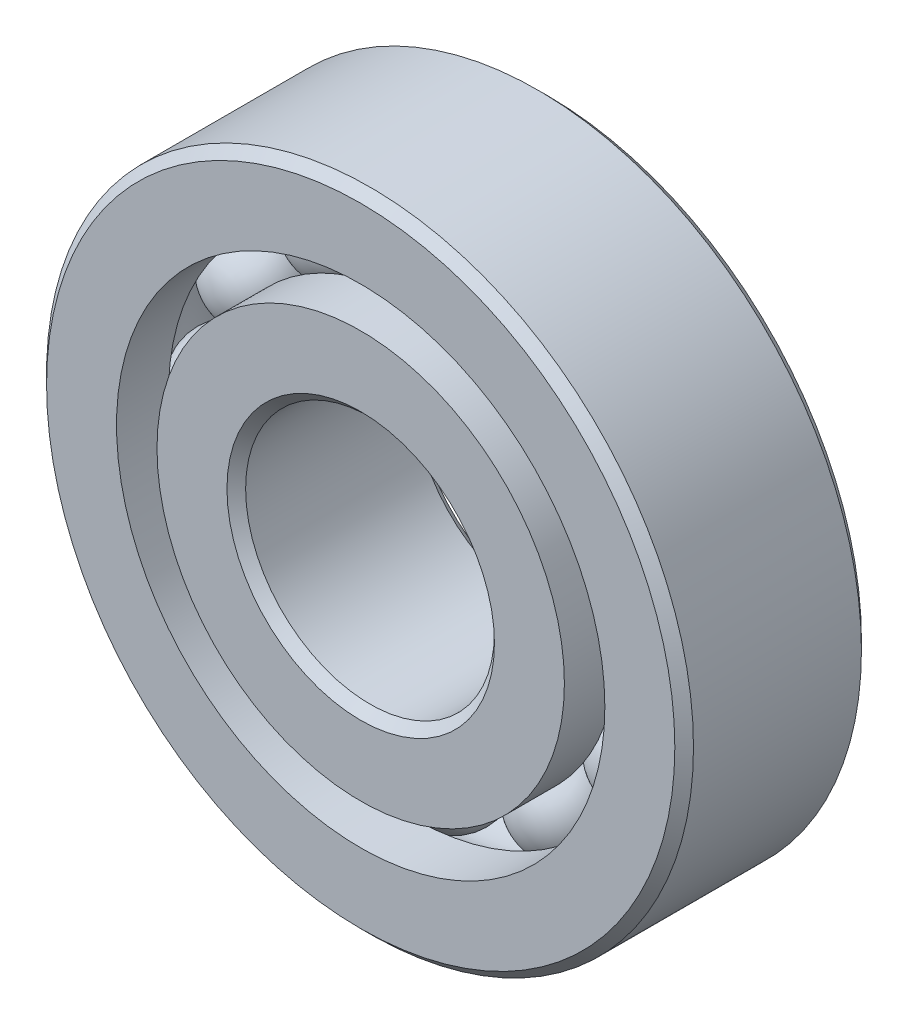
ISO-10303-21;
HEADER;
FILE_DESCRIPTION(('STEP AP214'),'2;1');
FILE_NAME('part.step','',(''),(''),'','','');
FILE_SCHEMA(('AUTOMOTIVE_DESIGN { 1 0 10303 214 1 1 1 1 }'));
ENDSEC;
DATA;
#1=APPLICATION_CONTEXT('core data for automotive mechanical design processes');
#2=APPLICATION_PROTOCOL_DEFINITION('international standard','automotive_design',2000,#1);
#3=PRODUCT_CONTEXT('',#1,'mechanical');
#4=PRODUCT('Part','Part','',(#3));
#5=PRODUCT_RELATED_PRODUCT_CATEGORY('part','',(#4));
#6=PRODUCT_DEFINITION_FORMATION('','',#4);
#7=PRODUCT_DEFINITION_CONTEXT('part definition',#1,'design');
#8=PRODUCT_DEFINITION('design','',#6,#7);
#9=PRODUCT_DEFINITION_SHAPE('','',#8);
#10=(LENGTH_UNIT() NAMED_UNIT(*) SI_UNIT(.MILLI.,.METRE.));
#11=(NAMED_UNIT(*) PLANE_ANGLE_UNIT() SI_UNIT($,.RADIAN.));
#12=(NAMED_UNIT(*) SI_UNIT($,.STERADIAN.) SOLID_ANGLE_UNIT());
#13=UNCERTAINTY_MEASURE_WITH_UNIT(LENGTH_MEASURE(1.E-05),#10,'distance_accuracy_value','');
#14=(GEOMETRIC_REPRESENTATION_CONTEXT(3) GLOBAL_UNCERTAINTY_ASSIGNED_CONTEXT((#13)) GLOBAL_UNIT_ASSIGNED_CONTEXT((#10,
#11,#12)) REPRESENTATION_CONTEXT('',''));
#15=CARTESIAN_POINT('',(0.,0.,0.));
#16=DIRECTION('',(0.,0.,1.));
#17=DIRECTION('',(1.,0.,0.));
#18=AXIS2_PLACEMENT_3D('',#15,#16,#17);
#19=CARTESIAN_POINT('',(-8.9999999999998,15.58845726812,0.));
#20=DIRECTION('',(0.,0.,1.));
#21=DIRECTION('',(-0.499999999999989,0.866025403784445,0.));
#22=AXIS2_PLACEMENT_3D('',#19,#20,#21);
#23=SPHERICAL_SURFACE('',#22,3.70893546501888);
#24=CARTESIAN_POINT('',(-8.9999999999998,15.58845726812,3.70893546501888));
#25=VERTEX_POINT('',#24);
#26=VERTEX_LOOP('',#25);
#27=FACE_BOUND('',#26,.T.);
#28=ADVANCED_FACE('F37',(#27),#23,.T.);
#29=CLOSED_SHELL('',(#28));
#30=MANIFOLD_SOLID_BREP('B2',#29);
#31=CARTESIAN_POINT('',(-15.5884572681198,9.00000000000018,0.));
#32=DIRECTION('',(0.,0.,1.));
#33=DIRECTION('',(-0.866025403784433,0.50000000000001,0.));
#34=AXIS2_PLACEMENT_3D('',#31,#32,#33);
#35=SPHERICAL_SURFACE('',#34,3.70893546501888);
#36=CARTESIAN_POINT('',(-15.5884572681198,9.00000000000018,3.70893546501888));
#37=VERTEX_POINT('',#36);
#38=VERTEX_LOOP('',#37);
#39=FACE_BOUND('',#38,.T.);
#40=ADVANCED_FACE('F57',(#39),#35,.T.);
#41=CLOSED_SHELL('',(#40));
#42=MANIFOLD_SOLID_BREP('B6',#41);
#43=CARTESIAN_POINT('',(-18.,1.88539992297529E-13,0.));
#44=DIRECTION('',(0.,0.,1.));
#45=DIRECTION('',(-1.,0.,0.));
#46=AXIS2_PLACEMENT_3D('',#43,#44,#45);
#47=SPHERICAL_SURFACE('',#46,3.70893546501888);
#48=CARTESIAN_POINT('',(-18.,1.88539992297529E-13,3.70893546501888));
#49=VERTEX_POINT('',#48);
#50=VERTEX_LOOP('',#49);
#51=FACE_BOUND('',#50,.T.);
#52=ADVANCED_FACE('F77',(#51),#47,.T.);
#53=CLOSED_SHELL('',(#52));
#54=MANIFOLD_SOLID_BREP('B33',#53);
#55=CARTESIAN_POINT('',(-15.58845726812,-8.99999999999985,0.));
#56=DIRECTION('',(0.,0.,1.));
#57=DIRECTION('',(-0.866025403784443,-0.499999999999992,0.));
#58=AXIS2_PLACEMENT_3D('',#55,#56,#57);
#59=SPHERICAL_SURFACE('',#58,3.70893546501888);
#60=CARTESIAN_POINT('',(-15.58845726812,-8.99999999999985,3.70893546501888));
#61=VERTEX_POINT('',#60);
#62=VERTEX_LOOP('',#61);
#63=FACE_BOUND('',#62,.T.);
#64=ADVANCED_FACE('F97',(#63),#59,.T.);
#65=CLOSED_SHELL('',(#64));
#66=MANIFOLD_SOLID_BREP('B53',#65);
#67=CARTESIAN_POINT('',(-9.00000000000013,-15.5884572681198,0.));
#68=DIRECTION('',(0.,0.,1.));
#69=DIRECTION('',(-0.500000000000007,-0.866025403784435,0.));
#70=AXIS2_PLACEMENT_3D('',#67,#68,#69);
#71=SPHERICAL_SURFACE('',#70,3.70893546501888);
#72=CARTESIAN_POINT('',(-9.00000000000013,-15.5884572681198,3.70893546501888));
#73=VERTEX_POINT('',#72);
#74=VERTEX_LOOP('',#73);
#75=FACE_BOUND('',#74,.T.);
#76=ADVANCED_FACE('F117',(#75),#71,.T.);
#77=CLOSED_SHELL('',(#76));
#78=MANIFOLD_SOLID_BREP('B73',#77);
#79=CARTESIAN_POINT('',(-1.25693328198353E-13,-18.,0.));
#80=DIRECTION('',(0.,0.,1.));
#81=DIRECTION('',(0.,-1.,0.));
#82=AXIS2_PLACEMENT_3D('',#79,#80,#81);
#83=SPHERICAL_SURFACE('',#82,3.70893546501888);
#84=CARTESIAN_POINT('',(-1.25693328198353E-13,-18.,3.70893546501888));
#85=VERTEX_POINT('',#84);
#86=VERTEX_LOOP('',#85);
#87=FACE_BOUND('',#86,.T.);
#88=ADVANCED_FACE('F137',(#87),#83,.T.);
#89=CLOSED_SHELL('',(#88));
#90=MANIFOLD_SOLID_BREP('B93',#89);
#91=CARTESIAN_POINT('',(8.99999999999991,-15.5884572681199,0.));
#92=DIRECTION('',(0.,0.,1.));
#93=DIRECTION('',(0.499999999999995,-0.866025403784442,0.));
#94=AXIS2_PLACEMENT_3D('',#91,#92,#93);
#95=SPHERICAL_SURFACE('',#94,3.70893546501888);
#96=CARTESIAN_POINT('',(8.99999999999991,-15.5884572681199,3.70893546501888));
#97=VERTEX_POINT('',#96);
#98=VERTEX_LOOP('',#97);
#99=FACE_BOUND('',#98,.T.);
#100=ADVANCED_FACE('F157',(#99),#95,.T.);
#101=CLOSED_SHELL('',(#100));
#102=MANIFOLD_SOLID_BREP('B113',#101);
#103=CARTESIAN_POINT('',(15.5884572681199,-9.00000000000007,0.));
#104=DIRECTION('',(0.,0.,1.));
#105=DIRECTION('',(0.866025403784436,-0.500000000000004,0.));
#106=AXIS2_PLACEMENT_3D('',#103,#104,#105);
#107=SPHERICAL_SURFACE('',#106,3.70893546501888);
#108=CARTESIAN_POINT('',(15.5884572681199,-9.00000000000007,3.70893546501888));
#109=VERTEX_POINT('',#108);
#110=VERTEX_LOOP('',#109);
#111=FACE_BOUND('',#110,.T.);
#112=ADVANCED_FACE('F177',(#111),#107,.T.);
#113=CLOSED_SHELL('',(#112));
#114=MANIFOLD_SOLID_BREP('B133',#113);
#115=CARTESIAN_POINT('',(18.,0.,0.));
#116=DIRECTION('',(0.,0.,1.));
#117=DIRECTION('',(1.,0.,0.));
#118=AXIS2_PLACEMENT_3D('',#115,#116,#117);
#119=SPHERICAL_SURFACE('',#118,3.70893546501888);
#120=CARTESIAN_POINT('',(18.,0.,3.70893546501888));
#121=VERTEX_POINT('',#120);
#122=VERTEX_LOOP('',#121);
#123=FACE_BOUND('',#122,.T.);
#124=ADVANCED_FACE('F197',(#123),#119,.T.);
#125=CLOSED_SHELL('',(#124));
#126=MANIFOLD_SOLID_BREP('B153',#125);
#127=CARTESIAN_POINT('',(15.5884572681199,8.99999999999996,0.));
#128=DIRECTION('',(0.,0.,1.));
#129=DIRECTION('',(0.86602540378444,0.499999999999998,0.));
#130=AXIS2_PLACEMENT_3D('',#127,#128,#129);
#131=SPHERICAL_SURFACE('',#130,3.70893546501888);
#132=CARTESIAN_POINT('',(15.5884572681199,8.99999999999996,3.70893546501888));
#133=VERTEX_POINT('',#132);
#134=VERTEX_LOOP('',#133);
#135=FACE_BOUND('',#134,.T.);
#136=ADVANCED_FACE('F217',(#135),#131,.T.);
#137=CLOSED_SHELL('',(#136));
#138=MANIFOLD_SOLID_BREP('B173',#137);
#139=CARTESIAN_POINT('',(9.00000000000002,15.5884572681199,0.));
#140=DIRECTION('',(0.,0.,1.));
#141=DIRECTION('',(0.500000000000001,0.866025403784438,0.));
#142=AXIS2_PLACEMENT_3D('',#139,#140,#141);
#143=SPHERICAL_SURFACE('',#142,3.70893546501888);
#144=CARTESIAN_POINT('',(9.00000000000002,15.5884572681199,3.70893546501888));
#145=VERTEX_POINT('',#144);
#146=VERTEX_LOOP('',#145);
#147=FACE_BOUND('',#146,.T.);
#148=ADVANCED_FACE('F237',(#147),#143,.T.);
#149=CLOSED_SHELL('',(#148));
#150=MANIFOLD_SOLID_BREP('B193',#149);
#151=CARTESIAN_POINT('',(0.,18.,0.));
#152=DIRECTION('',(0.,0.,1.));
#153=DIRECTION('',(0.,1.,0.));
#154=AXIS2_PLACEMENT_3D('',#151,#152,#153);
#155=SPHERICAL_SURFACE('',#154,3.70893546501888);
#156=CARTESIAN_POINT('',(0.,18.,3.70893546501888));
#157=VERTEX_POINT('',#156);
#158=VERTEX_LOOP('',#157);
#159=FACE_BOUND('',#158,.T.);
#160=ADVANCED_FACE('F259',(#159),#155,.T.);
#161=CLOSED_SHELL('',(#160));
#162=MANIFOLD_SOLID_BREP('B213',#161);
#163=CARTESIAN_POINT('',(0.,16.3736263736264,7.5));
#164=DIRECTION('',(0.,0.,-1.));
#165=DIRECTION('',(-1.,0.,0.));
#166=AXIS2_PLACEMENT_3D('',#163,#164,#165);
#167=PLANE('',#166);
#168=CARTESIAN_POINT('',(0.,0.,7.5));
#169=DIRECTION('',(0.,0.,1.));
#170=DIRECTION('',(1.,0.,0.));
#171=AXIS2_PLACEMENT_3D('',#168,#169,#170);
#172=CIRCLE('',#171,10.75);
#173=CARTESIAN_POINT('',(10.75,0.,7.5));
#174=VERTEX_POINT('',#173);
#175=EDGE_CURVE('E306',#174,#174,#172,.T.);
#176=ORIENTED_EDGE('',*,*,#175,.F.);
#177=EDGE_LOOP('',(#176));
#178=FACE_BOUND('',#177,.T.);
#179=CARTESIAN_POINT('',(0.,0.,7.50000000000001));
#180=DIRECTION('',(0.,0.,1.));
#181=DIRECTION('',(1.,0.,0.));
#182=AXIS2_PLACEMENT_3D('',#179,#180,#181);
#183=CIRCLE('',#182,16.3736263736264);
#184=CARTESIAN_POINT('',(16.3736263736264,0.,7.50000000000001));
#185=VERTEX_POINT('',#184);
#186=EDGE_CURVE('E258',#185,#185,#183,.T.);
#187=ORIENTED_EDGE('',*,*,#186,.T.);
#188=EDGE_LOOP('',(#187));
#189=FACE_BOUND('',#188,.T.);
#190=ADVANCED_FACE('F278',(#178,#189),#167,.F.);
#191=CARTESIAN_POINT('',(0.,0.,7.5));
#192=DIRECTION('',(0.,0.,1.));
#193=DIRECTION('',(1.,0.,0.));
#194=AXIS2_PLACEMENT_3D('',#191,#192,#193);
#195=CYLINDRICAL_SURFACE('',#194,16.3736263736264);
#196=ORIENTED_EDGE('',*,*,#186,.F.);
#197=EDGE_LOOP('',(#196));
#198=FACE_BOUND('',#197,.T.);
#199=CARTESIAN_POINT('',(0.,0.,3.33333333333333));
#200=DIRECTION('',(0.,0.,1.));
#201=DIRECTION('',(1.,0.,0.));
#202=AXIS2_PLACEMENT_3D('',#199,#200,#201);
#203=CIRCLE('',#202,16.3736263736264);
#204=CARTESIAN_POINT('',(16.3736263736264,0.,3.33333333333333));
#205=VERTEX_POINT('',#204);
#206=EDGE_CURVE('E284',#205,#205,#203,.T.);
#207=ORIENTED_EDGE('',*,*,#206,.T.);
#208=EDGE_LOOP('',(#207));
#209=FACE_BOUND('',#208,.T.);
#210=ADVANCED_FACE('F313',(#198,#209),#195,.T.);
#211=CARTESIAN_POINT('',(0.,0.,0.));
#212=DIRECTION('',(0.,0.,1.));
#213=DIRECTION('',(1.,0.,0.));
#214=AXIS2_PLACEMENT_3D('',#211,#212,#213);
#215=TOROIDAL_SURFACE('',#214,18.,3.70893546501887);
#216=ORIENTED_EDGE('',*,*,#206,.F.);
#217=EDGE_LOOP('',(#216));
#218=FACE_BOUND('',#217,.T.);
#219=CARTESIAN_POINT('',(0.,0.,-3.33333333333334));
#220=DIRECTION('',(0.,0.,1.));
#221=DIRECTION('',(1.,0.,0.));
#222=AXIS2_PLACEMENT_3D('',#219,#220,#221);
#223=CIRCLE('',#222,16.3736263736264);
#224=CARTESIAN_POINT('',(16.3736263736264,0.,-3.33333333333334));
#225=VERTEX_POINT('',#224);
#226=EDGE_CURVE('E288',#225,#225,#223,.T.);
#227=ORIENTED_EDGE('',*,*,#226,.T.);
#228=EDGE_LOOP('',(#227));
#229=FACE_BOUND('',#228,.T.);
#230=ADVANCED_FACE('F317',(#218,#229),#215,.F.);
#231=CARTESIAN_POINT('',(0.,0.,7.5));
#232=DIRECTION('',(0.,0.,1.));
#233=DIRECTION('',(1.,0.,0.));
#234=AXIS2_PLACEMENT_3D('',#231,#232,#233);
#235=CYLINDRICAL_SURFACE('',#234,16.3736263736264);
#236=ORIENTED_EDGE('',*,*,#226,.F.);
#237=EDGE_LOOP('',(#236));
#238=FACE_BOUND('',#237,.T.);
#239=CARTESIAN_POINT('',(0.,0.,-7.50000000000001));
#240=DIRECTION('',(0.,0.,1.));
#241=DIRECTION('',(1.,0.,0.));
#242=AXIS2_PLACEMENT_3D('',#239,#240,#241);
#243=CIRCLE('',#242,16.3736263736264);
#244=CARTESIAN_POINT('',(16.3736263736264,0.,-7.50000000000001));
#245=VERTEX_POINT('',#244);
#246=EDGE_CURVE('E292',#245,#245,#243,.T.);
#247=ORIENTED_EDGE('',*,*,#246,.T.);
#248=EDGE_LOOP('',(#247));
#249=FACE_BOUND('',#248,.T.);
#250=ADVANCED_FACE('F322',(#238,#249),#235,.T.);
#251=CARTESIAN_POINT('',(0.,10.75,-7.50000000000001));
#252=DIRECTION('',(0.,0.,1.));
#253=DIRECTION('',(1.,0.,0.));
#254=AXIS2_PLACEMENT_3D('',#251,#252,#253);
#255=PLANE('',#254);
#256=ORIENTED_EDGE('',*,*,#246,.F.);
#257=EDGE_LOOP('',(#256));
#258=FACE_BOUND('',#257,.T.);
#259=CARTESIAN_POINT('',(0.,0.,-7.50000000000001));
#260=DIRECTION('',(0.,0.,1.));
#261=DIRECTION('',(1.,0.,0.));
#262=AXIS2_PLACEMENT_3D('',#259,#260,#261);
#263=CIRCLE('',#262,10.75);
#264=CARTESIAN_POINT('',(10.75,0.,-7.50000000000001));
#265=VERTEX_POINT('',#264);
#266=EDGE_CURVE('E297',#265,#265,#263,.T.);
#267=ORIENTED_EDGE('',*,*,#266,.T.);
#268=EDGE_LOOP('',(#267));
#269=FACE_BOUND('',#268,.T.);
#270=ADVANCED_FACE('F328',(#258,#269),#255,.F.);
#271=CARTESIAN_POINT('',(0.,0.,-6.75000000000001));
#272=DIRECTION('',(0.,0.,-1.));
#273=DIRECTION('',(-1.,0.,0.));
#274=AXIS2_PLACEMENT_3D('',#271,#272,#273);
#275=CONICAL_SURFACE('',#274,10.,0.785398163397444);
#276=ORIENTED_EDGE('',*,*,#266,.F.);
#277=EDGE_LOOP('',(#276));
#278=FACE_BOUND('',#277,.T.);
#279=CARTESIAN_POINT('',(0.,0.,-6.75000000000001));
#280=DIRECTION('',(0.,0.,1.));
#281=DIRECTION('',(1.,0.,0.));
#282=AXIS2_PLACEMENT_3D('',#279,#280,#281);
#283=CIRCLE('',#282,10.);
#284=CARTESIAN_POINT('',(10.,0.,-6.75000000000001));
#285=VERTEX_POINT('',#284);
#286=EDGE_CURVE('E300',#285,#285,#283,.T.);
#287=ORIENTED_EDGE('',*,*,#286,.T.);
#288=EDGE_LOOP('',(#287));
#289=FACE_BOUND('',#288,.T.);
#290=ADVANCED_FACE('F332',(#278,#289),#275,.F.);
#291=CARTESIAN_POINT('',(0.,0.,7.5));
#292=DIRECTION('',(0.,0.,1.));
#293=DIRECTION('',(1.,0.,0.));
#294=AXIS2_PLACEMENT_3D('',#291,#292,#293);
#295=CYLINDRICAL_SURFACE('',#294,10.);
#296=ORIENTED_EDGE('',*,*,#286,.F.);
#297=EDGE_LOOP('',(#296));
#298=FACE_BOUND('',#297,.T.);
#299=CARTESIAN_POINT('',(0.,0.,6.75000000000001));
#300=DIRECTION('',(0.,0.,1.));
#301=DIRECTION('',(1.,0.,0.));
#302=AXIS2_PLACEMENT_3D('',#299,#300,#301);
#303=CIRCLE('',#302,10.);
#304=CARTESIAN_POINT('',(10.,0.,6.75000000000001));
#305=VERTEX_POINT('',#304);
#306=EDGE_CURVE('E303',#305,#305,#303,.T.);
#307=ORIENTED_EDGE('',*,*,#306,.T.);
#308=EDGE_LOOP('',(#307));
#309=FACE_BOUND('',#308,.T.);
#310=ADVANCED_FACE('F336',(#298,#309),#295,.F.);
#311=CARTESIAN_POINT('',(0.,0.,7.5));
#312=DIRECTION('',(0.,0.,1.));
#313=DIRECTION('',(1.,0.,0.));
#314=AXIS2_PLACEMENT_3D('',#311,#312,#313);
#315=CONICAL_SURFACE('',#314,10.75,0.785398163397454);
#316=ORIENTED_EDGE('',*,*,#306,.F.);
#317=EDGE_LOOP('',(#316));
#318=FACE_BOUND('',#317,.T.);
#319=ORIENTED_EDGE('',*,*,#175,.T.);
#320=EDGE_LOOP('',(#319));
#321=FACE_BOUND('',#320,.T.);
#322=ADVANCED_FACE('F310',(#318,#321),#315,.F.);
#323=CLOSED_SHELL('',(#190,#210,#230,#250,#270,#290,#310,#322));
#324=MANIFOLD_SOLID_BREP('B233',#323);
#325=CARTESIAN_POINT('',(0.,0.,6.75));
#326=DIRECTION('',(0.,0.,-1.));
#327=DIRECTION('',(-1.,0.,0.));
#328=AXIS2_PLACEMENT_3D('',#325,#326,#327);
#329=CONICAL_SURFACE('',#328,26.,0.785398163397447);
#330=CARTESIAN_POINT('',(0.,0.,7.5));
#331=DIRECTION('',(0.,0.,1.));
#332=DIRECTION('',(1.,0.,0.));
#333=AXIS2_PLACEMENT_3D('',#330,#331,#332);
#334=CIRCLE('',#333,25.25);
#335=CARTESIAN_POINT('',(25.25,0.,7.5));
#336=VERTEX_POINT('',#335);
#337=EDGE_CURVE('E427',#336,#336,#334,.T.);
#338=ORIENTED_EDGE('',*,*,#337,.F.);
#339=EDGE_LOOP('',(#338));
#340=FACE_BOUND('',#339,.T.);
#341=CARTESIAN_POINT('',(0.,0.,6.75));
#342=DIRECTION('',(0.,0.,1.));
#343=DIRECTION('',(1.,0.,0.));
#344=AXIS2_PLACEMENT_3D('',#341,#342,#343);
#345=CIRCLE('',#344,26.);
#346=CARTESIAN_POINT('',(26.,0.,6.75));
#347=VERTEX_POINT('',#346);
#348=EDGE_CURVE('E277',#347,#347,#345,.T.);
#349=ORIENTED_EDGE('',*,*,#348,.T.);
#350=EDGE_LOOP('',(#349));
#351=FACE_BOUND('',#350,.T.);
#352=ADVANCED_FACE('F399',(#340,#351),#329,.T.);
#353=CARTESIAN_POINT('',(0.,0.,7.5));
#354=DIRECTION('',(0.,0.,1.));
#355=DIRECTION('',(1.,0.,0.));
#356=AXIS2_PLACEMENT_3D('',#353,#354,#355);
#357=CYLINDRICAL_SURFACE('',#356,26.);
#358=ORIENTED_EDGE('',*,*,#348,.F.);
#359=EDGE_LOOP('',(#358));
#360=FACE_BOUND('',#359,.T.);
#361=CARTESIAN_POINT('',(0.,0.,-6.75));
#362=DIRECTION('',(0.,0.,1.));
#363=DIRECTION('',(1.,0.,0.));
#364=AXIS2_PLACEMENT_3D('',#361,#362,#363);
#365=CIRCLE('',#364,26.);
#366=CARTESIAN_POINT('',(26.,0.,-6.75));
#367=VERTEX_POINT('',#366);
#368=EDGE_CURVE('E405',#367,#367,#365,.T.);
#369=ORIENTED_EDGE('',*,*,#368,.T.);
#370=EDGE_LOOP('',(#369));
#371=FACE_BOUND('',#370,.T.);
#372=ADVANCED_FACE('F434',(#360,#371),#357,.T.);
#373=CARTESIAN_POINT('',(0.,0.,-7.50000000000001));
#374=DIRECTION('',(0.,0.,1.));
#375=DIRECTION('',(1.,0.,0.));
#376=AXIS2_PLACEMENT_3D('',#373,#374,#375);
#377=CONICAL_SURFACE('',#376,25.25,0.785398163397443);
#378=ORIENTED_EDGE('',*,*,#368,.F.);
#379=EDGE_LOOP('',(#378));
#380=FACE_BOUND('',#379,.T.);
#381=CARTESIAN_POINT('',(0.,0.,-7.50000000000001));
#382=DIRECTION('',(0.,0.,1.));
#383=DIRECTION('',(1.,0.,0.));
#384=AXIS2_PLACEMENT_3D('',#381,#382,#383);
#385=CIRCLE('',#384,25.25);
#386=CARTESIAN_POINT('',(25.25,0.,-7.50000000000001));
#387=VERTEX_POINT('',#386);
#388=EDGE_CURVE('E409',#387,#387,#385,.T.);
#389=ORIENTED_EDGE('',*,*,#388,.T.);
#390=EDGE_LOOP('',(#389));
#391=FACE_BOUND('',#390,.T.);
#392=ADVANCED_FACE('F438',(#380,#391),#377,.T.);
#393=CARTESIAN_POINT('',(0.,25.25,-7.50000000000001));
#394=DIRECTION('',(0.,0.,1.));
#395=DIRECTION('',(1.,0.,0.));
#396=AXIS2_PLACEMENT_3D('',#393,#394,#395);
#397=PLANE('',#396);
#398=ORIENTED_EDGE('',*,*,#388,.F.);
#399=EDGE_LOOP('',(#398));
#400=FACE_BOUND('',#399,.T.);
#401=CARTESIAN_POINT('',(0.,0.,-7.50000000000001));
#402=DIRECTION('',(0.,0.,1.));
#403=DIRECTION('',(1.,0.,0.));
#404=AXIS2_PLACEMENT_3D('',#401,#402,#403);
#405=CIRCLE('',#404,19.6263736263736);
#406=CARTESIAN_POINT('',(19.6263736263736,0.,-7.50000000000001));
#407=VERTEX_POINT('',#406);
#408=EDGE_CURVE('E413',#407,#407,#405,.T.);
#409=ORIENTED_EDGE('',*,*,#408,.T.);
#410=EDGE_LOOP('',(#409));
#411=FACE_BOUND('',#410,.T.);
#412=ADVANCED_FACE('F443',(#400,#411),#397,.F.);
#413=CARTESIAN_POINT('',(0.,0.,7.5));
#414=DIRECTION('',(0.,0.,1.));
#415=DIRECTION('',(1.,0.,0.));
#416=AXIS2_PLACEMENT_3D('',#413,#414,#415);
#417=CYLINDRICAL_SURFACE('',#416,19.6263736263736);
#418=ORIENTED_EDGE('',*,*,#408,.F.);
#419=EDGE_LOOP('',(#418));
#420=FACE_BOUND('',#419,.T.);
#421=CARTESIAN_POINT('',(0.,0.,-3.33333333333334));
#422=DIRECTION('',(0.,0.,1.));
#423=DIRECTION('',(1.,0.,0.));
#424=AXIS2_PLACEMENT_3D('',#421,#422,#423);
#425=CIRCLE('',#424,19.6263736263736);
#426=CARTESIAN_POINT('',(19.6263736263736,0.,-3.33333333333334));
#427=VERTEX_POINT('',#426);
#428=EDGE_CURVE('E418',#427,#427,#425,.T.);
#429=ORIENTED_EDGE('',*,*,#428,.T.);
#430=EDGE_LOOP('',(#429));
#431=FACE_BOUND('',#430,.T.);
#432=ADVANCED_FACE('F449',(#420,#431),#417,.F.);
#433=CARTESIAN_POINT('',(0.,0.,0.));
#434=DIRECTION('',(0.,0.,1.));
#435=DIRECTION('',(1.,0.,0.));
#436=AXIS2_PLACEMENT_3D('',#433,#434,#435);
#437=TOROIDAL_SURFACE('',#436,18.,3.70893546501888);
#438=ORIENTED_EDGE('',*,*,#428,.F.);
#439=EDGE_LOOP('',(#438));
#440=FACE_BOUND('',#439,.T.);
#441=CARTESIAN_POINT('',(0.,0.,3.33333333333333));
#442=DIRECTION('',(0.,0.,1.));
#443=DIRECTION('',(1.,0.,0.));
#444=AXIS2_PLACEMENT_3D('',#441,#442,#443);
#445=CIRCLE('',#444,19.6263736263736);
#446=CARTESIAN_POINT('',(19.6263736263736,0.,3.33333333333333));
#447=VERTEX_POINT('',#446);
#448=EDGE_CURVE('E421',#447,#447,#445,.T.);
#449=ORIENTED_EDGE('',*,*,#448,.T.);
#450=EDGE_LOOP('',(#449));
#451=FACE_BOUND('',#450,.T.);
#452=ADVANCED_FACE('F453',(#440,#451),#437,.F.);
#453=CARTESIAN_POINT('',(0.,0.,7.5));
#454=DIRECTION('',(0.,0.,1.));
#455=DIRECTION('',(1.,0.,0.));
#456=AXIS2_PLACEMENT_3D('',#453,#454,#455);
#457=CYLINDRICAL_SURFACE('',#456,19.6263736263736);
#458=ORIENTED_EDGE('',*,*,#448,.F.);
#459=EDGE_LOOP('',(#458));
#460=FACE_BOUND('',#459,.T.);
#461=CARTESIAN_POINT('',(0.,0.,7.5));
#462=DIRECTION('',(0.,0.,1.));
#463=DIRECTION('',(1.,0.,0.));
#464=AXIS2_PLACEMENT_3D('',#461,#462,#463);
#465=CIRCLE('',#464,19.6263736263736);
#466=CARTESIAN_POINT('',(19.6263736263736,0.,7.5));
#467=VERTEX_POINT('',#466);
#468=EDGE_CURVE('E424',#467,#467,#465,.T.);
#469=ORIENTED_EDGE('',*,*,#468,.T.);
#470=EDGE_LOOP('',(#469));
#471=FACE_BOUND('',#470,.T.);
#472=ADVANCED_FACE('F457',(#460,#471),#457,.F.);
#473=CARTESIAN_POINT('',(0.,25.25,7.5));
#474=DIRECTION('',(0.,0.,-1.));
#475=DIRECTION('',(-1.,0.,0.));
#476=AXIS2_PLACEMENT_3D('',#473,#474,#475);
#477=PLANE('',#476);
#478=ORIENTED_EDGE('',*,*,#468,.F.);
#479=EDGE_LOOP('',(#478));
#480=FACE_BOUND('',#479,.T.);
#481=ORIENTED_EDGE('',*,*,#337,.T.);
#482=EDGE_LOOP('',(#481));
#483=FACE_BOUND('',#482,.T.);
#484=ADVANCED_FACE('F431',(#480,#483),#477,.F.);
#485=CLOSED_SHELL('',(#352,#372,#392,#412,#432,#452,#472,#484));
#486=MANIFOLD_SOLID_BREP('B253',#485);
#487=ADVANCED_BREP_SHAPE_REPRESENTATION('',(#18,#30,#42,#54,#66,#78,#90,#102,#114,#126,#138,
#150,#162,#324,#486),#14);
#488=SHAPE_DEFINITION_REPRESENTATION(#9,#487);
ENDSEC;
END-ISO-10303-21;
